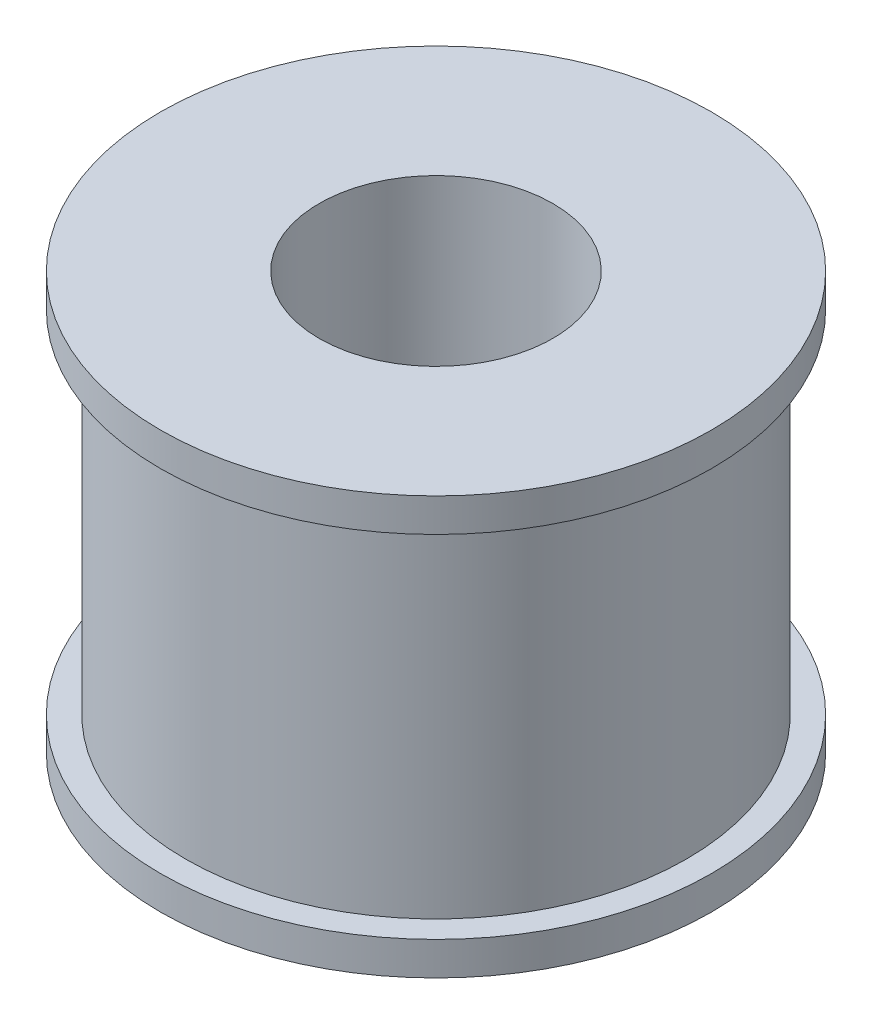
ISO-10303-21;
HEADER;
FILE_DESCRIPTION(('STEP AP214'),'2;1');
FILE_NAME('part.step','',(''),(''),'','','');
FILE_SCHEMA(('AUTOMOTIVE_DESIGN { 1 0 10303 214 1 1 1 1 }'));
ENDSEC;
DATA;
#1=APPLICATION_CONTEXT('core data for automotive mechanical design processes');
#2=APPLICATION_PROTOCOL_DEFINITION('international standard','automotive_design',2000,#1);
#3=PRODUCT_CONTEXT('',#1,'mechanical');
#4=PRODUCT('Part','Part','',(#3));
#5=PRODUCT_RELATED_PRODUCT_CATEGORY('part','',(#4));
#6=PRODUCT_DEFINITION_FORMATION('','',#4);
#7=PRODUCT_DEFINITION_CONTEXT('part definition',#1,'design');
#8=PRODUCT_DEFINITION('design','',#6,#7);
#9=PRODUCT_DEFINITION_SHAPE('','',#8);
#10=(LENGTH_UNIT() NAMED_UNIT(*) SI_UNIT(.MILLI.,.METRE.));
#11=(NAMED_UNIT(*) PLANE_ANGLE_UNIT() SI_UNIT($,.RADIAN.));
#12=(NAMED_UNIT(*) SI_UNIT($,.STERADIAN.) SOLID_ANGLE_UNIT());
#13=UNCERTAINTY_MEASURE_WITH_UNIT(LENGTH_MEASURE(1.E-05),#10,'distance_accuracy_value','');
#14=(GEOMETRIC_REPRESENTATION_CONTEXT(3) GLOBAL_UNCERTAINTY_ASSIGNED_CONTEXT((#13)) GLOBAL_UNIT_ASSIGNED_CONTEXT((#10,
#11,#12)) REPRESENTATION_CONTEXT('',''));
#15=CARTESIAN_POINT('',(0.,0.,0.));
#16=DIRECTION('',(0.,0.,1.));
#17=DIRECTION('',(1.,0.,0.));
#18=AXIS2_PLACEMENT_3D('',#15,#16,#17);
#19=CARTESIAN_POINT('',(0.,25.,0.));
#20=DIRECTION('',(0.,-1.,0.));
#21=DIRECTION('',(0.,0.,-1.));
#22=AXIS2_PLACEMENT_3D('',#19,#20,#21);
#23=CYLINDRICAL_SURFACE('',#22,3.);
#24=CARTESIAN_POINT('',(0.,0.,0.));
#25=DIRECTION('',(0.,1.,0.));
#26=DIRECTION('',(0.,0.,1.));
#27=AXIS2_PLACEMENT_3D('',#24,#25,#26);
#28=CIRCLE('',#27,3.);
#29=CARTESIAN_POINT('',(0.,0.,3.));
#30=VERTEX_POINT('',#29);
#31=EDGE_CURVE('E45',#30,#30,#28,.T.);
#32=ORIENTED_EDGE('',*,*,#31,.F.);
#33=EDGE_LOOP('',(#32));
#34=FACE_BOUND('',#33,.T.);
#35=CARTESIAN_POINT('',(1.625,5.,-2.521780125229));
#36=CARTESIAN_POINT('',(1.62499362610396,4.91647567107102,-2.52178884654117));
#37=CARTESIAN_POINT('',(1.61851585641467,4.83287244644267,-2.52599501945757));
#38=CARTESIAN_POINT('',(1.59297861462206,4.6683256364093,-2.54217064533891));
#39=CARTESIAN_POINT('',(1.57389710574364,4.58738697049031,-2.55415369499862));
#40=CARTESIAN_POINT('',(1.52427817740289,4.43087471587903,-2.58406681920894));
#41=CARTESIAN_POINT('',(1.49381028464491,4.35527181130049,-2.60196072584982));
#42=CARTESIAN_POINT('',(1.42249724665063,4.21027693964684,-2.64162110161326));
#43=CARTESIAN_POINT('',(1.38165016988108,4.14088613187722,-2.66338829131529));
#44=CARTESIAN_POINT('',(1.28606573612756,4.00281297757973,-2.71093173114226));
#45=CARTESIAN_POINT('',(1.23036059831293,3.93486364791188,-2.7368918673873));
#46=CARTESIAN_POINT('',(1.10864243894811,3.8086867522882,-2.78841941781855));
#47=CARTESIAN_POINT('',(1.04262348172815,3.75046482469484,-2.81398659649028));
#48=CARTESIAN_POINT('',(0.89551160217396,3.64066872614016,-2.86436429896294));
#49=CARTESIAN_POINT('',(0.813624236880456,3.59003997769905,-2.88893816491266));
#50=CARTESIAN_POINT('',(0.640911470519763,3.5036176638638,-2.9320863076302));
#51=CARTESIAN_POINT('',(0.550092737901573,3.46781313274385,-2.95066501686498));
#52=CARTESIAN_POINT('',(0.369897501143644,3.41510793344741,-2.97838863309815));
#53=CARTESIAN_POINT('',(0.281002067442789,3.39690896510625,-2.98817676403926));
#54=CARTESIAN_POINT('',(0.100927404427291,3.37561060880875,-2.99965505637116));
#55=CARTESIAN_POINT('',(0.00974989246369477,3.37250019032237,-3.00135113346747));
#56=CARTESIAN_POINT('',(-0.162347576331279,3.38107155998096,-2.99671477897577));
#57=CARTESIAN_POINT('',(-0.243368142517105,3.39128192920775,-2.99118088232813));
#58=CARTESIAN_POINT('',(-0.402336701214962,3.42350767664372,-2.97397337010464));
#59=CARTESIAN_POINT('',(-0.480284458564604,3.44552395648496,-2.96229928559631));
#60=CARTESIAN_POINT('',(-0.63207455464856,3.50076381349264,-2.93368734546312));
#61=CARTESIAN_POINT('',(-0.705859929075177,3.53411235165183,-2.91669097245024));
#62=CARTESIAN_POINT('',(-0.846938184886932,3.61083633152674,-2.87889510857995));
#63=CARTESIAN_POINT('',(-0.91422892621452,3.65421506242804,-2.85809437063173));
#64=CARTESIAN_POINT('',(-1.04801466719267,3.75499915650264,-2.8119717864549));
#65=CARTESIAN_POINT('',(-1.11367327603698,3.81340264002554,-2.78640445121692));
#66=CARTESIAN_POINT('',(-1.23475234459078,3.93995606194131,-2.73490853839924));
#67=CARTESIAN_POINT('',(-1.2901626002163,4.00811559576566,-2.7089796281294));
#68=CARTESIAN_POINT('',(-1.39377486129465,4.15911791911366,-2.65725751747602));
#69=CARTESIAN_POINT('',(-1.44098913960444,4.24271143567745,-2.63165629719171));
#70=CARTESIAN_POINT('',(-1.5203587042321,4.41828931014661,-2.58662109254775));
#71=CARTESIAN_POINT('',(-1.55253127212028,4.51026389300709,-2.56718003903186));
#72=CARTESIAN_POINT('',(-1.59812522493745,4.69228534022437,-2.53902859798761));
#73=CARTESIAN_POINT('',(-1.61285549939508,4.78188382300329,-2.52957594769987));
#74=CARTESIAN_POINT('',(-1.62709553982775,4.96273938431094,-2.52044556051586));
#75=CARTESIAN_POINT('',(-1.6266213251134,5.05399461596327,-2.52075753569134));
#76=CARTESIAN_POINT('',(-1.6116650884512,5.22196402891728,-2.53033241096107));
#77=CARTESIAN_POINT('',(-1.59913775035001,5.2989374702016,-2.53834610426687));
#78=CARTESIAN_POINT('',(-1.56351314461445,5.44948708742494,-2.56044192007669));
#79=CARTESIAN_POINT('',(-1.54041149876914,5.52306184225863,-2.57452655606692));
#80=CARTESIAN_POINT('',(-1.48330763694687,5.66842211919627,-2.60785937209035));
#81=CARTESIAN_POINT('',(-1.44887654692676,5.73999204648474,-2.62730481169378));
#82=CARTESIAN_POINT('',(-1.37044806619068,5.87676666541915,-2.66905325078274));
#83=CARTESIAN_POINT('',(-1.32644586554113,5.94196813265417,-2.69135768472439));
#84=CARTESIAN_POINT('',(-1.22230316396257,6.07459354253663,-2.74039556583206));
#85=CARTESIAN_POINT('',(-1.16072421643766,6.14083561603439,-2.76728512045753));
#86=CARTESIAN_POINT('',(-1.02707583252912,6.26250184432116,-2.81962198065225));
#87=CARTESIAN_POINT('',(-0.955000762805303,6.31792015229087,-2.84506850148092));
#88=CARTESIAN_POINT('',(-0.798115671580059,6.41870176479678,-2.89310153929838));
#89=CARTESIAN_POINT('',(-0.712872708944511,6.46348615652539,-2.91550295414492));
#90=CARTESIAN_POINT('',(-0.534505621432121,6.53760486976178,-2.9534021705525));
#91=CARTESIAN_POINT('',(-0.44138960806974,6.56695487331969,-2.96890697690612));
#92=CARTESIAN_POINT('',(-0.259992391421341,6.60647524542024,-2.98996496264615));
#93=CARTESIAN_POINT('',(-0.172164501552213,6.61827549628704,-2.99636104576615));
#94=CARTESIAN_POINT('',(0.00444487101537017,6.62739394717314,-3.00129434113477));
#95=CARTESIAN_POINT('',(0.093225862830992,6.62471927583816,-2.99983542183636));
#96=CARTESIAN_POINT('',(0.261188522805945,6.60590681183214,-2.98969237921464));
#97=CARTESIAN_POINT('',(0.340543637188175,6.59093537023404,-2.98163436789865));
#98=CARTESIAN_POINT('',(0.495432823547957,6.54970841054607,-2.95984216222459));
#99=CARTESIAN_POINT('',(0.570966424731545,6.52345150590093,-2.94610727040123));
#100=CARTESIAN_POINT('',(0.719186038389683,6.45950257807398,-2.91354409902028));
#101=CARTESIAN_POINT('',(0.791671383281743,6.42143261692066,-2.89455012777675));
#102=CARTESIAN_POINT('',(0.929476456393731,6.3354043604806,-2.8532886071291));
#103=CARTESIAN_POINT('',(0.99479316752873,6.287441925984,-2.83101968854409));
#104=CARTESIAN_POINT('',(1.12421459926918,6.17677982546555,-2.78234471532874));
#105=CARTESIAN_POINT('',(1.18735256260398,6.11302832046199,-2.75575528045836));
#106=CARTESIAN_POINT('',(1.30249662530647,5.97578738089303,-2.7032419755199));
#107=CARTESIAN_POINT('',(1.35448979132518,5.9022867910228,-2.67731890912275));
#108=CARTESIAN_POINT('',(1.44880285545911,5.74212188572276,-2.62754301941557));
#109=CARTESIAN_POINT('',(1.49035401575236,5.65493203097275,-2.60390811353569));
#110=CARTESIAN_POINT('',(1.55758520350058,5.47314904038028,-2.56427012470215));
#111=CARTESIAN_POINT('',(1.58331656006501,5.37858098159521,-2.54824239842196));
#112=CARTESIAN_POINT('',(1.60851613266538,5.2356472359366,-2.53234221331271));
#113=CARTESIAN_POINT('',(1.61468341643518,5.18882820241346,-2.52840291933054));
#114=CARTESIAN_POINT('',(1.62292718367799,5.0946812366103,-2.52311938607778));
#115=CARTESIAN_POINT('',(1.62500361361774,5.04735329767885,-2.52177518076675));
#116=CARTESIAN_POINT('',(1.625,5.,-2.521780125229));
#117=B_SPLINE_CURVE_WITH_KNOTS('',3,(#35,#36,#37,#38,#39,#40,#41,#42,#43,#44,#45,#46,#47,#48,
#49,#50,#51,#52,#53,#54,#55,#56,#57,#58,#59,#60,#61,#62,#63,#64,#65,#66,#67,#68,#69,#70,#71,#72,
#73,#74,#75,#76,#77,#78,#79,#80,#81,#82,#83,#84,#85,#86,#87,#88,#89,#90,#91,#92,#93,#94,#95,#96,
#97,#98,#99,#100,#101,#102,#103,#104,#105,#106,#107,#108,#109,#110,#111,#112,#113,#114,#115,
#116),.UNSPECIFIED.,.T.,.F.,(4,2,2,2,2,2,2,2,2,2,2,2,2,2,2,2,2,2,2,2,2,2,2,2,2,2,2,2,2,2,2,2,2,
2,2,2,2,2,2,2,4),(0.,0.250372371078242,0.501183664001882,0.750487850304348,0.999838465347706,
1.27357587393855,1.54747140449562,1.84397527167813,2.14025941634808,2.41249928639615,
2.68454010463896,2.92892931461192,3.17333719155109,3.42053266619159,3.66780931851591,
3.94123094413897,4.21492336171583,4.51146085049713,4.80765680207996,5.079836201185,
5.35172884399928,5.58585847738579,5.82008513815954,6.06445887718592,6.30895571043233,
6.59079991795693,6.87279595452077,7.16774738273199,7.46239854482431,7.72746451911719,
7.99239996494183,8.23476524078876,8.47716030264913,8.72828927356825,8.97952353584611,
9.25908071892252,9.53896058773721,9.83565375839589,10.1313791234398,10.2733234218883,
10.4152695778198),.UNSPECIFIED.);
#118=CARTESIAN_POINT('',(1.625,5.,-2.521780125229));
#119=VERTEX_POINT('',#118);
#120=EDGE_CURVE('E69',#119,#119,#117,.T.);
#121=ORIENTED_EDGE('',*,*,#120,.T.);
#122=EDGE_LOOP('',(#121));
#123=FACE_BOUND('',#122,.T.);
#124=CARTESIAN_POINT('',(0.,9.,0.));
#125=DIRECTION('',(0.,1.,0.));
#126=DIRECTION('',(0.,0.,1.));
#127=AXIS2_PLACEMENT_3D('',#124,#125,#126);
#128=CIRCLE('',#127,3.);
#129=CARTESIAN_POINT('',(0.,9.,3.));
#130=VERTEX_POINT('',#129);
#131=EDGE_CURVE('E36',#130,#130,#128,.T.);
#132=ORIENTED_EDGE('',*,*,#131,.T.);
#133=EDGE_LOOP('',(#132));
#134=FACE_BOUND('',#133,.T.);
#135=ADVANCED_FACE('F32',(#34,#123,#134),#23,.F.);
#136=CARTESIAN_POINT('',(0.,25.,0.));
#137=DIRECTION('',(0.,-1.,0.));
#138=DIRECTION('',(0.,0.,-1.));
#139=AXIS2_PLACEMENT_3D('',#136,#137,#138);
#140=CYLINDRICAL_SURFACE('',#139,15.);
#141=CARTESIAN_POINT('',(1.625,5.,-14.9117193844305));
#142=CARTESIAN_POINT('',(1.62499607951809,4.9090108416416,-14.9117205336342));
#143=CARTESIAN_POINT('',(1.61733206770543,4.81796253610688,-14.9125611691408));
#144=CARTESIAN_POINT('',(1.58687625220947,4.63839321362523,-14.915832168487));
#145=CARTESIAN_POINT('',(1.56406804372355,4.54987504600155,-14.9182642562102));
#146=CARTESIAN_POINT('',(1.50399836576417,4.37799225972297,-14.9244395173036));
#147=CARTESIAN_POINT('',(1.46674598159897,4.29462443966606,-14.9281818663832));
#148=CARTESIAN_POINT('',(1.37886351672704,4.13534161716927,-14.9365549747082));
#149=CARTESIAN_POINT('',(1.32823597825778,4.05942520218556,-14.9411855650784));
#150=CARTESIAN_POINT('',(1.21480991566068,3.91686096045494,-14.9508354029994));
#151=CARTESIAN_POINT('',(1.15196613450361,3.85024923206282,-14.9558560527334));
#152=CARTESIAN_POINT('',(1.01598848819612,3.7284963918019,-14.9657076223121));
#153=CARTESIAN_POINT('',(0.942854140085716,3.67335581860202,-14.9705385332384));
#154=CARTESIAN_POINT('',(0.788148146230986,3.5759840546106,-14.979480349489));
#155=CARTESIAN_POINT('',(0.706556115495929,3.53378507179415,-14.9835894477508));
#156=CARTESIAN_POINT('',(0.537392028738915,3.46370047953315,-14.9906093408174));
#157=CARTESIAN_POINT('',(0.449820142002624,3.43581446508836,-14.993520169528));
#158=CARTESIAN_POINT('',(0.271548635235109,3.39525397713153,-14.9978056971795));
#159=CARTESIAN_POINT('',(0.180862714678987,3.38251993717447,-14.9991864099331));
#160=CARTESIAN_POINT('',(-0.00136887809288493,3.37244046943757,-15.0002766179743));
#161=CARTESIAN_POINT('',(-0.0929145243656087,3.37509457878616,-14.99998616353));
#162=CARTESIAN_POINT('',(-0.273862279448701,3.39566790771732,-14.9977716675837));
#163=CARTESIAN_POINT('',(-0.36327176672863,3.41352307287695,-14.9958544809421));
#164=CARTESIAN_POINT('',(-0.537817561741082,3.46389177662204,-14.9906097658352));
#165=CARTESIAN_POINT('',(-0.622953805784831,3.49640553360832,-14.9872822163566));
#166=CARTESIAN_POINT('',(-0.786737204499769,3.57523805176723,-14.979579002581));
#167=CARTESIAN_POINT('',(-0.865370704832735,3.62158496440318,-14.9752012045523));
#168=CARTESIAN_POINT('',(-1.0137675205992,3.72674772430712,-14.9658882801973));
#169=CARTESIAN_POINT('',(-1.08353053033313,3.78556400111476,-14.9609531346744));
#170=CARTESIAN_POINT('',(-1.21258158390715,3.9143557017455,-14.9510489609166));
#171=CARTESIAN_POINT('',(-1.27181399609965,3.9843868798984,-14.9460798888296));
#172=CARTESIAN_POINT('',(-1.37769125065725,4.13342770218761,-14.9366931075787));
#173=CARTESIAN_POINT('',(-1.42433606915497,4.21243736334765,-14.9322753994602));
#174=CARTESIAN_POINT('',(-1.50371485192156,4.37723721180423,-14.9244913010396));
#175=CARTESIAN_POINT('',(-1.53644506541173,4.46302921994805,-14.9211251942686));
#176=CARTESIAN_POINT('',(-1.58701989180505,4.6389358914823,-14.9158311966687));
#177=CARTESIAN_POINT('',(-1.60486503894023,4.72905039961339,-14.9139032542237));
#178=CARTESIAN_POINT('',(-1.62509096228955,4.91055475629357,-14.9117129877457));
#179=CARTESIAN_POINT('',(-1.6275497095449,5.00193581884558,-14.9114422658505));
#180=CARTESIAN_POINT('',(-1.61713810395813,5.18380861017386,-14.9125749184418));
#181=CARTESIAN_POINT('',(-1.60426799494733,5.27430035307318,-14.9139782662994));
#182=CARTESIAN_POINT('',(-1.56362937642419,5.45159653584044,-14.9182932910546));
#183=CARTESIAN_POINT('',(-1.53589800835291,5.53840958838293,-14.9212012070943));
#184=CARTESIAN_POINT('',(-1.46636207739473,5.70615233356266,-14.9281946726837));
#185=CARTESIAN_POINT('',(-1.42455713824991,5.78708186883329,-14.9322802537179));
#186=CARTESIAN_POINT('',(-1.32786654917253,5.94111487230612,-14.941188975875));
#187=CARTESIAN_POINT('',(-1.27292939659526,6.01418584194673,-14.9460149935006));
#188=CARTESIAN_POINT('',(-1.15160734855488,6.15009731222767,-14.9558515297871));
#189=CARTESIAN_POINT('',(-1.08522212005016,6.2129375151363,-14.9608620538123));
#190=CARTESIAN_POINT('',(-0.942549364034599,6.32687408297659,-14.970528538951));
#191=CARTESIAN_POINT('',(-0.866221001315747,6.37791946791369,-14.9751829048162));
#192=CARTESIAN_POINT('',(-0.706029387134965,6.46646600456177,-14.9835892449075));
#193=CARTESIAN_POINT('',(-0.622166254347312,6.50396736954735,-14.9873412333428));
#194=CARTESIAN_POINT('',(-0.449460968850121,6.56427563446597,-14.9935129098066));
#195=CARTESIAN_POINT('',(-0.360629526752095,6.58711291323968,-14.995935350668));
#196=CARTESIAN_POINT('',(-0.180365296449006,6.6175437924483,-14.999186329398));
#197=CARTESIAN_POINT('',(-0.0889325950610979,6.62513790102089,-15.0000149203982));
#198=CARTESIAN_POINT('',(0.09343890925348,6.62485900793099,-14.9999847446418));
#199=CARTESIAN_POINT('',(0.18437784462988,6.61706497990256,-14.9991345933745));
#200=CARTESIAN_POINT('',(0.363646086561017,6.58639717389963,-14.9958594851579));
#201=CARTESIAN_POINT('',(0.451975392109846,6.56352339011256,-14.9934345276017));
#202=CARTESIAN_POINT('',(0.623513348873704,6.50336819065134,-14.9872813405323));
#203=CARTESIAN_POINT('',(0.706722983882575,6.46608955309469,-14.9835533623327));
#204=CARTESIAN_POINT('',(0.865716968282426,6.37819112870105,-14.9752088384087));
#205=CARTESIAN_POINT('',(0.941501319840049,6.32757134575692,-14.9705922929434));
#206=CARTESIAN_POINT('',(1.08389799384492,6.21413237859641,-14.960958916983));
#207=CARTESIAN_POINT('',(1.15046331474937,6.15125435063952,-14.9559402273796));
#208=CARTESIAN_POINT('',(1.27213126805333,6.01520254653594,-14.9460837090211));
#209=CARTESIAN_POINT('',(1.3272311582968,5.94202631439452,-14.9412459237589));
#210=CARTESIAN_POINT('',(1.42453604787585,5.78721552316423,-14.9322837858294));
#211=CARTESIAN_POINT('',(1.46670268012169,5.7055567413385,-14.9281615713388));
#212=CARTESIAN_POINT('',(1.53666786469777,5.53632304387261,-14.9211225978569));
#213=CARTESIAN_POINT('',(1.56448244506817,5.44875485190011,-14.9182044948746));
#214=CARTESIAN_POINT('',(1.59810281600453,5.30058619999483,-14.9146316623786));
#215=CARTESIAN_POINT('',(1.60817525625295,5.24092938535957,-14.913544806398));
#216=CARTESIAN_POINT('',(1.62162513312488,5.12085707759251,-14.9120882875807));
#217=CARTESIAN_POINT('',(1.62500260426801,5.06044158837411,-14.9117186210462));
#218=CARTESIAN_POINT('',(1.625,5.,-14.9117193844305));
#219=B_SPLINE_CURVE_WITH_KNOTS('',3,(#141,#142,#143,#144,#145,#146,#147,#148,#149,#150,#151,
#152,#153,#154,#155,#156,#157,#158,#159,#160,#161,#162,#163,#164,#165,#166,#167,#168,#169,#170,
#171,#172,#173,#174,#175,#176,#177,#178,#179,#180,#181,#182,#183,#184,#185,#186,#187,#188,#189,
#190,#191,#192,#193,#194,#195,#196,#197,#198,#199,#200,#201,#202,#203,#204,#205,#206,#207,#208,
#209,#210,#211,#212,#213,#214,#215,#216,#217,#218),.UNSPECIFIED.,.T.,.F.,(4,2,2,2,2,2,2,2,2,2,2,
2,2,2,2,2,2,2,2,2,2,2,2,2,2,2,2,2,2,2,2,2,2,2,2,2,2,2,4),(0.,0.272746729141454,
0.545789391564964,0.818660589509165,1.09147995964616,1.36532998736278,1.63919287178087,
1.91373189405753,2.18826314754028,2.46171154174663,2.73515171073829,3.00744532447488,
3.2797429952938,3.55259863422501,3.82546367390541,4.09972995287852,4.37399675188556,
4.64833743461444,4.92266827070322,5.1956077937417,5.46854297527464,5.74079919344049,
6.01306269097386,6.28641201040306,6.55976928331395,6.83428684697462,7.10880008768134,
7.38274278269506,7.65667634555892,7.92920770492192,8.20173916933351,8.4742180995881,
8.74669695033509,9.02051751499351,9.29440349349468,9.5690942792563,9.84347762910006,
10.0246566929585,10.2058348226453),.UNSPECIFIED.);
#220=CARTESIAN_POINT('',(1.625,5.,-14.9117193844305));
#221=VERTEX_POINT('',#220);
#222=EDGE_CURVE('E74',#221,#221,#219,.T.);
#223=ORIENTED_EDGE('',*,*,#222,.F.);
#224=EDGE_LOOP('',(#223));
#225=FACE_BOUND('',#224,.T.);
#226=CARTESIAN_POINT('',(0.,2.,0.));
#227=DIRECTION('',(0.,-1.,0.));
#228=DIRECTION('',(0.,0.,-1.));
#229=AXIS2_PLACEMENT_3D('',#226,#227,#228);
#230=CIRCLE('',#229,15.);
#231=CARTESIAN_POINT('',(0.,2.,-15.));
#232=VERTEX_POINT('',#231);
#233=EDGE_CURVE('E40',#232,#232,#230,.T.);
#234=ORIENTED_EDGE('',*,*,#233,.F.);
#235=EDGE_LOOP('',(#234));
#236=FACE_BOUND('',#235,.T.);
#237=CARTESIAN_POINT('',(0.,23.,0.));
#238=DIRECTION('',(0.,1.,0.));
#239=DIRECTION('',(0.,0.,1.));
#240=AXIS2_PLACEMENT_3D('',#237,#238,#239);
#241=CIRCLE('',#240,15.);
#242=CARTESIAN_POINT('',(0.,23.,15.));
#243=VERTEX_POINT('',#242);
#244=EDGE_CURVE('E10',#243,#243,#241,.T.);
#245=ORIENTED_EDGE('',*,*,#244,.F.);
#246=EDGE_LOOP('',(#245));
#247=FACE_BOUND('',#246,.T.);
#248=ADVANCED_FACE('F34',(#225,#236,#247),#140,.T.);
#249=CARTESIAN_POINT('',(0.,25.,0.));
#250=DIRECTION('',(0.,1.,0.));
#251=DIRECTION('',(0.,0.,1.));
#252=AXIS2_PLACEMENT_3D('',#249,#250,#251);
#253=PLANE('',#252);
#254=CARTESIAN_POINT('',(0.,25.,0.));
#255=DIRECTION('',(0.,1.,0.));
#256=DIRECTION('',(0.,0.,1.));
#257=AXIS2_PLACEMENT_3D('',#254,#255,#256);
#258=CIRCLE('',#257,7.);
#259=CARTESIAN_POINT('',(0.,25.,7.));
#260=VERTEX_POINT('',#259);
#261=EDGE_CURVE('E77',#260,#260,#258,.T.);
#262=ORIENTED_EDGE('',*,*,#261,.F.);
#263=EDGE_LOOP('',(#262));
#264=FACE_BOUND('',#263,.T.);
#265=CARTESIAN_POINT('',(0.,25.,0.));
#266=DIRECTION('',(0.,1.,0.));
#267=DIRECTION('',(0.,0.,1.));
#268=AXIS2_PLACEMENT_3D('',#265,#266,#267);
#269=CIRCLE('',#268,16.5);
#270=CARTESIAN_POINT('',(0.,25.,16.5));
#271=VERTEX_POINT('',#270);
#272=EDGE_CURVE('E49',#271,#271,#269,.T.);
#273=ORIENTED_EDGE('',*,*,#272,.T.);
#274=EDGE_LOOP('',(#273));
#275=FACE_BOUND('',#274,.T.);
#276=ADVANCED_FACE('F157',(#264,#275),#253,.T.);
#277=CARTESIAN_POINT('',(0.,0.,0.));
#278=DIRECTION('',(0.,1.,0.));
#279=DIRECTION('',(0.,0.,1.));
#280=AXIS2_PLACEMENT_3D('',#277,#278,#279);
#281=PLANE('',#280);
#282=ORIENTED_EDGE('',*,*,#31,.T.);
#283=EDGE_LOOP('',(#282));
#284=FACE_BOUND('',#283,.T.);
#285=CARTESIAN_POINT('',(0.,0.,0.));
#286=DIRECTION('',(0.,-1.,0.));
#287=DIRECTION('',(0.,0.,-1.));
#288=AXIS2_PLACEMENT_3D('',#285,#286,#287);
#289=CIRCLE('',#288,16.5);
#290=CARTESIAN_POINT('',(0.,0.,-16.5));
#291=VERTEX_POINT('',#290);
#292=EDGE_CURVE('E54',#291,#291,#289,.T.);
#293=ORIENTED_EDGE('',*,*,#292,.T.);
#294=EDGE_LOOP('',(#293));
#295=FACE_BOUND('',#294,.T.);
#296=ADVANCED_FACE('F60',(#284,#295),#281,.F.);
#297=CARTESIAN_POINT('',(0.,2.,0.));
#298=DIRECTION('',(0.,-1.,0.));
#299=DIRECTION('',(0.,0.,-1.));
#300=AXIS2_PLACEMENT_3D('',#297,#298,#299);
#301=PLANE('',#300);
#302=CARTESIAN_POINT('',(0.,2.,0.));
#303=DIRECTION('',(0.,-1.,0.));
#304=DIRECTION('',(0.,0.,-1.));
#305=AXIS2_PLACEMENT_3D('',#302,#303,#304);
#306=CIRCLE('',#305,16.5);
#307=CARTESIAN_POINT('',(0.,2.,-16.5));
#308=VERTEX_POINT('',#307);
#309=EDGE_CURVE('E51',#308,#308,#306,.T.);
#310=ORIENTED_EDGE('',*,*,#309,.F.);
#311=EDGE_LOOP('',(#310));
#312=FACE_BOUND('',#311,.T.);
#313=ORIENTED_EDGE('',*,*,#233,.T.);
#314=EDGE_LOOP('',(#313));
#315=FACE_BOUND('',#314,.T.);
#316=ADVANCED_FACE('F142',(#312,#315),#301,.F.);
#317=CARTESIAN_POINT('',(0.,2.,0.));
#318=DIRECTION('',(0.,-1.,0.));
#319=DIRECTION('',(0.,0.,-1.));
#320=AXIS2_PLACEMENT_3D('',#317,#318,#319);
#321=CYLINDRICAL_SURFACE('',#320,16.5);
#322=ORIENTED_EDGE('',*,*,#309,.T.);
#323=EDGE_LOOP('',(#322));
#324=FACE_BOUND('',#323,.T.);
#325=ORIENTED_EDGE('',*,*,#292,.F.);
#326=EDGE_LOOP('',(#325));
#327=FACE_BOUND('',#326,.T.);
#328=ADVANCED_FACE('F135',(#324,#327),#321,.T.);
#329=CARTESIAN_POINT('',(0.,23.,0.));
#330=DIRECTION('',(0.,1.,0.));
#331=DIRECTION('',(0.,0.,1.));
#332=AXIS2_PLACEMENT_3D('',#329,#330,#331);
#333=PLANE('',#332);
#334=CARTESIAN_POINT('',(0.,23.,0.));
#335=DIRECTION('',(0.,1.,0.));
#336=DIRECTION('',(0.,0.,1.));
#337=AXIS2_PLACEMENT_3D('',#334,#335,#336);
#338=CIRCLE('',#337,16.5);
#339=CARTESIAN_POINT('',(0.,23.,16.5));
#340=VERTEX_POINT('',#339);
#341=EDGE_CURVE('E56',#340,#340,#338,.T.);
#342=ORIENTED_EDGE('',*,*,#341,.F.);
#343=EDGE_LOOP('',(#342));
#344=FACE_BOUND('',#343,.T.);
#345=ORIENTED_EDGE('',*,*,#244,.T.);
#346=EDGE_LOOP('',(#345));
#347=FACE_BOUND('',#346,.T.);
#348=ADVANCED_FACE('F127',(#344,#347),#333,.F.);
#349=CARTESIAN_POINT('',(0.,23.,0.));
#350=DIRECTION('',(0.,1.,0.));
#351=DIRECTION('',(0.,0.,1.));
#352=AXIS2_PLACEMENT_3D('',#349,#350,#351);
#353=CYLINDRICAL_SURFACE('',#352,16.5);
#354=ORIENTED_EDGE('',*,*,#341,.T.);
#355=EDGE_LOOP('',(#354));
#356=FACE_BOUND('',#355,.T.);
#357=ORIENTED_EDGE('',*,*,#272,.F.);
#358=EDGE_LOOP('',(#357));
#359=FACE_BOUND('',#358,.T.);
#360=ADVANCED_FACE('F118',(#356,#359),#353,.T.);
#361=CARTESIAN_POINT('',(0.,5.,-16.501));
#362=DIRECTION('',(0.,0.,1.));
#363=DIRECTION('',(1.,0.,0.));
#364=AXIS2_PLACEMENT_3D('',#361,#362,#363);
#365=CYLINDRICAL_SURFACE('',#364,1.625);
#366=ORIENTED_EDGE('',*,*,#120,.F.);
#367=EDGE_LOOP('',(#366));
#368=FACE_BOUND('',#367,.T.);
#369=ORIENTED_EDGE('',*,*,#222,.T.);
#370=EDGE_LOOP('',(#369));
#371=FACE_BOUND('',#370,.T.);
#372=ADVANCED_FACE('F93',(#368,#371),#365,.F.);
#373=CARTESIAN_POINT('',(0.,9.,0.));
#374=DIRECTION('',(0.,1.,0.));
#375=DIRECTION('',(0.,0.,1.));
#376=AXIS2_PLACEMENT_3D('',#373,#374,#375);
#377=CYLINDRICAL_SURFACE('',#376,7.);
#378=CARTESIAN_POINT('',(0.,9.,0.));
#379=DIRECTION('',(0.,1.,0.));
#380=DIRECTION('',(0.,0.,1.));
#381=AXIS2_PLACEMENT_3D('',#378,#379,#380);
#382=CIRCLE('',#381,7.);
#383=CARTESIAN_POINT('',(0.,9.,7.));
#384=VERTEX_POINT('',#383);
#385=EDGE_CURVE('E73',#384,#384,#382,.T.);
#386=ORIENTED_EDGE('',*,*,#385,.F.);
#387=EDGE_LOOP('',(#386));
#388=FACE_BOUND('',#387,.T.);
#389=ORIENTED_EDGE('',*,*,#261,.T.);
#390=EDGE_LOOP('',(#389));
#391=FACE_BOUND('',#390,.T.);
#392=ADVANCED_FACE('F98',(#388,#391),#377,.F.);
#393=CARTESIAN_POINT('',(0.,9.,0.));
#394=DIRECTION('',(0.,1.,0.));
#395=DIRECTION('',(0.,0.,1.));
#396=AXIS2_PLACEMENT_3D('',#393,#394,#395);
#397=PLANE('',#396);
#398=ORIENTED_EDGE('',*,*,#131,.F.);
#399=EDGE_LOOP('',(#398));
#400=FACE_BOUND('',#399,.T.);
#401=ORIENTED_EDGE('',*,*,#385,.T.);
#402=EDGE_LOOP('',(#401));
#403=FACE_BOUND('',#402,.T.);
#404=ADVANCED_FACE('F102',(#400,#403),#397,.T.);
#405=CLOSED_SHELL('',(#135,#248,#276,#296,#316,#328,#348,#360,#372,#392,#404));
#406=MANIFOLD_SOLID_BREP('B2',#405);
#407=ADVANCED_BREP_SHAPE_REPRESENTATION('',(#18,#406),#14);
#408=SHAPE_DEFINITION_REPRESENTATION(#9,#407);
ENDSEC;
END-ISO-10303-21;
